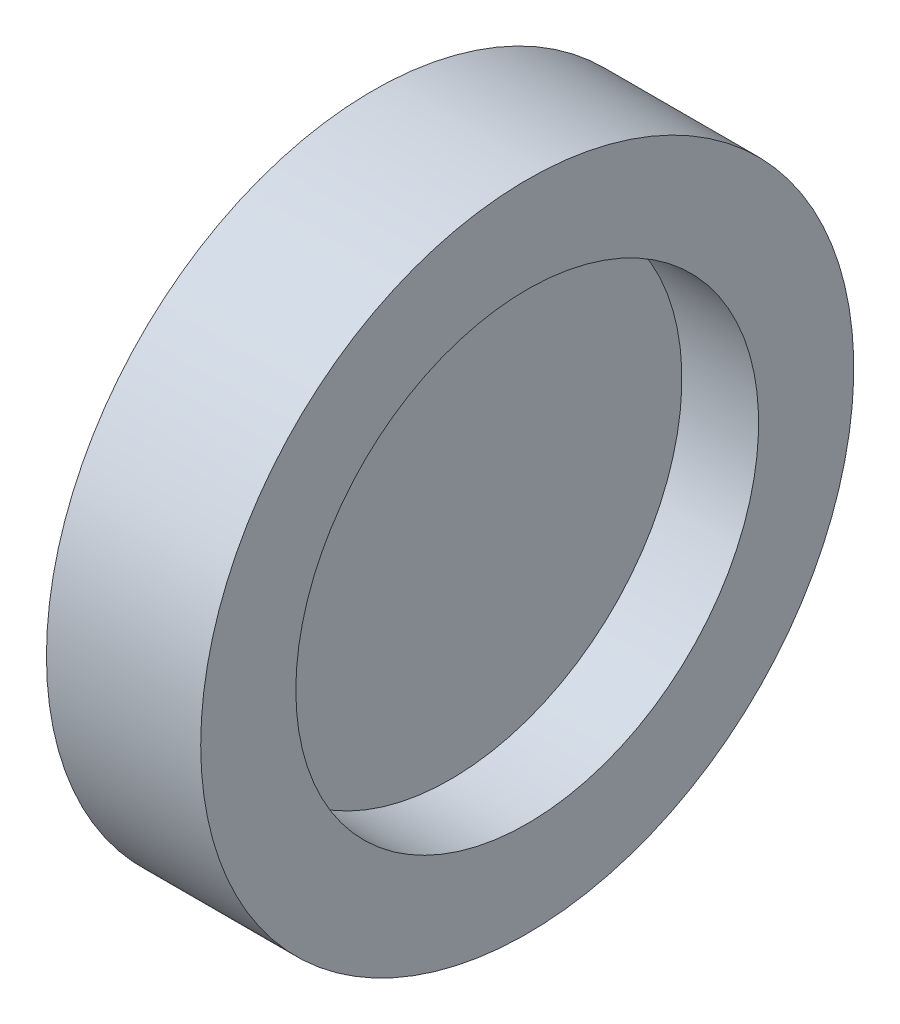
ISO-10303-21;
HEADER;
FILE_DESCRIPTION(('STEP AP214'),'2;1');
FILE_NAME('part.step','',(''),(''),'','','');
FILE_SCHEMA(('AUTOMOTIVE_DESIGN { 1 0 10303 214 1 1 1 1 }'));
ENDSEC;
DATA;
#1=APPLICATION_CONTEXT('core data for automotive mechanical design processes');
#2=APPLICATION_PROTOCOL_DEFINITION('international standard','automotive_design',2000,#1);
#3=PRODUCT_CONTEXT('',#1,'mechanical');
#4=PRODUCT('Part','Part','',(#3));
#5=PRODUCT_RELATED_PRODUCT_CATEGORY('part','',(#4));
#6=PRODUCT_DEFINITION_FORMATION('','',#4);
#7=PRODUCT_DEFINITION_CONTEXT('part definition',#1,'design');
#8=PRODUCT_DEFINITION('design','',#6,#7);
#9=PRODUCT_DEFINITION_SHAPE('','',#8);
#10=(LENGTH_UNIT() NAMED_UNIT(*) SI_UNIT(.MILLI.,.METRE.));
#11=(NAMED_UNIT(*) PLANE_ANGLE_UNIT() SI_UNIT($,.RADIAN.));
#12=(NAMED_UNIT(*) SI_UNIT($,.STERADIAN.) SOLID_ANGLE_UNIT());
#13=UNCERTAINTY_MEASURE_WITH_UNIT(LENGTH_MEASURE(1.E-05),#10,'distance_accuracy_value','');
#14=(GEOMETRIC_REPRESENTATION_CONTEXT(3) GLOBAL_UNCERTAINTY_ASSIGNED_CONTEXT((#13)) GLOBAL_UNIT_ASSIGNED_CONTEXT((#10,
#11,#12)) REPRESENTATION_CONTEXT('',''));
#15=CARTESIAN_POINT('',(0.,0.,0.));
#16=DIRECTION('',(0.,0.,1.));
#17=DIRECTION('',(1.,0.,0.));
#18=AXIS2_PLACEMENT_3D('',#15,#16,#17);
#19=CARTESIAN_POINT('',(0.0145000000000005,9.,0.));
#20=DIRECTION('',(-1.,0.,0.));
#21=DIRECTION('',(0.,0.,1.));
#22=AXIS2_PLACEMENT_3D('',#19,#20,#21);
#23=PLANE('',#22);
#24=CARTESIAN_POINT('',(0.0145000000000011,0.,0.));
#25=DIRECTION('',(-1.,0.,0.));
#26=DIRECTION('',(0.,0.,1.));
#27=AXIS2_PLACEMENT_3D('',#24,#25,#26);
#28=CIRCLE('',#27,9.);
#29=CARTESIAN_POINT('',(0.0145000000000011,0.,9.));
#30=VERTEX_POINT('',#29);
#31=EDGE_CURVE('E10',#30,#30,#28,.T.);
#32=ORIENTED_EDGE('',*,*,#31,.F.);
#33=EDGE_LOOP('',(#32));
#34=FACE_BOUND('',#33,.T.);
#35=ADVANCED_FACE('F37',(#34),#23,.F.);
#36=CARTESIAN_POINT('',(-1.61421241885762,0.,0.));
#37=DIRECTION('',(-1.,0.,0.));
#38=DIRECTION('',(0.,0.,1.));
#39=AXIS2_PLACEMENT_3D('',#36,#37,#38);
#40=CYLINDRICAL_SURFACE('',#39,9.);
#41=CARTESIAN_POINT('',(3.,0.,0.));
#42=DIRECTION('',(-1.,0.,0.));
#43=DIRECTION('',(0.,0.,1.));
#44=AXIS2_PLACEMENT_3D('',#41,#42,#43);
#45=CIRCLE('',#44,9.);
#46=CARTESIAN_POINT('',(3.,0.,9.));
#47=VERTEX_POINT('',#46);
#48=EDGE_CURVE('E60',#47,#47,#45,.T.);
#49=ORIENTED_EDGE('',*,*,#48,.F.);
#50=EDGE_LOOP('',(#49));
#51=FACE_BOUND('',#50,.T.);
#52=ORIENTED_EDGE('',*,*,#31,.T.);
#53=EDGE_LOOP('',(#52));
#54=FACE_BOUND('',#53,.T.);
#55=ADVANCED_FACE('F90',(#51,#54),#40,.F.);
#56=CARTESIAN_POINT('',(-3.,0.,0.));
#57=DIRECTION('',(-1.,0.,0.));
#58=DIRECTION('',(0.,0.,1.));
#59=AXIS2_PLACEMENT_3D('',#56,#57,#58);
#60=CIRCLE('',#59,9.);
#61=CARTESIAN_POINT('',(-3.,0.,9.));
#62=VERTEX_POINT('',#61);
#63=EDGE_CURVE('E64',#62,#62,#60,.T.);
#64=ORIENTED_EDGE('',*,*,#63,.T.);
#65=EDGE_LOOP('',(#64));
#66=FACE_BOUND('',#65,.T.);
#67=CARTESIAN_POINT('',(-0.0145000000000006,0.,0.));
#68=DIRECTION('',(1.,0.,0.));
#69=DIRECTION('',(0.,0.,-1.));
#70=AXIS2_PLACEMENT_3D('',#67,#68,#69);
#71=CIRCLE('',#70,9.);
#72=CARTESIAN_POINT('',(-0.0145000000000006,0.,-9.));
#73=VERTEX_POINT('',#72);
#74=EDGE_CURVE('E44',#73,#73,#71,.T.);
#75=ORIENTED_EDGE('',*,*,#74,.T.);
#76=EDGE_LOOP('',(#75));
#77=FACE_BOUND('',#76,.T.);
#78=ADVANCED_FACE('F69',(#66,#77),#40,.F.);
#79=CARTESIAN_POINT('',(-3.,9.,0.));
#80=DIRECTION('',(1.,0.,0.));
#81=DIRECTION('',(0.,0.,-1.));
#82=AXIS2_PLACEMENT_3D('',#79,#80,#81);
#83=PLANE('',#82);
#84=ORIENTED_EDGE('',*,*,#63,.F.);
#85=EDGE_LOOP('',(#84));
#86=FACE_BOUND('',#85,.T.);
#87=CARTESIAN_POINT('',(-3.,0.,0.));
#88=DIRECTION('',(-1.,0.,0.));
#89=DIRECTION('',(0.,0.,1.));
#90=AXIS2_PLACEMENT_3D('',#87,#88,#89);
#91=CIRCLE('',#90,12.7);
#92=CARTESIAN_POINT('',(-3.,0.,12.7));
#93=VERTEX_POINT('',#92);
#94=EDGE_CURVE('E49',#93,#93,#91,.T.);
#95=ORIENTED_EDGE('',*,*,#94,.T.);
#96=EDGE_LOOP('',(#95));
#97=FACE_BOUND('',#96,.T.);
#98=ADVANCED_FACE('F71',(#86,#97),#83,.F.);
#99=CARTESIAN_POINT('',(-1.61421241885762,0.,0.));
#100=DIRECTION('',(-1.,0.,0.));
#101=DIRECTION('',(0.,0.,1.));
#102=AXIS2_PLACEMENT_3D('',#99,#100,#101);
#103=CYLINDRICAL_SURFACE('',#102,12.7);
#104=ORIENTED_EDGE('',*,*,#94,.F.);
#105=EDGE_LOOP('',(#104));
#106=FACE_BOUND('',#105,.T.);
#107=CARTESIAN_POINT('',(3.,0.,0.));
#108=DIRECTION('',(-1.,0.,0.));
#109=DIRECTION('',(0.,0.,1.));
#110=AXIS2_PLACEMENT_3D('',#107,#108,#109);
#111=CIRCLE('',#110,12.7);
#112=CARTESIAN_POINT('',(3.,0.,12.7));
#113=VERTEX_POINT('',#112);
#114=EDGE_CURVE('E54',#113,#113,#111,.T.);
#115=ORIENTED_EDGE('',*,*,#114,.T.);
#116=EDGE_LOOP('',(#115));
#117=FACE_BOUND('',#116,.T.);
#118=ADVANCED_FACE('F74',(#106,#117),#103,.T.);
#119=CARTESIAN_POINT('',(3.,12.7,0.));
#120=DIRECTION('',(-1.,0.,0.));
#121=DIRECTION('',(0.,0.,1.));
#122=AXIS2_PLACEMENT_3D('',#119,#120,#121);
#123=PLANE('',#122);
#124=ORIENTED_EDGE('',*,*,#114,.F.);
#125=EDGE_LOOP('',(#124));
#126=FACE_BOUND('',#125,.T.);
#127=ORIENTED_EDGE('',*,*,#48,.T.);
#128=EDGE_LOOP('',(#127));
#129=FACE_BOUND('',#128,.T.);
#130=ADVANCED_FACE('F80',(#126,#129),#123,.F.);
#131=CARTESIAN_POINT('',(-0.0145000000000005,9.,0.));
#132=DIRECTION('',(1.,0.,0.));
#133=DIRECTION('',(0.,0.,-1.));
#134=AXIS2_PLACEMENT_3D('',#131,#132,#133);
#135=PLANE('',#134);
#136=ORIENTED_EDGE('',*,*,#74,.F.);
#137=EDGE_LOOP('',(#136));
#138=FACE_BOUND('',#137,.T.);
#139=ADVANCED_FACE('F86',(#138),#135,.F.);
#140=CLOSED_SHELL('',(#35,#55,#78,#98,#118,#130,#139));
#141=MANIFOLD_SOLID_BREP('B2',#140);
#142=ADVANCED_BREP_SHAPE_REPRESENTATION('',(#18,#141),#14);
#143=SHAPE_DEFINITION_REPRESENTATION(#9,#142);
ENDSEC;
END-ISO-10303-21;
